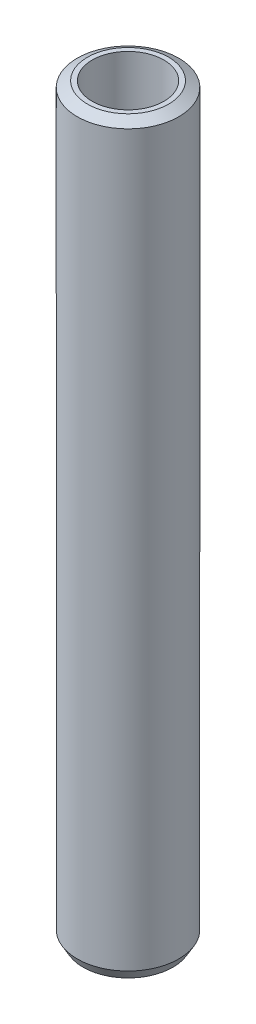
ISO-10303-21;
HEADER;
FILE_DESCRIPTION(('STEP AP214'),'2;1');
FILE_NAME('part.step','',(''),(''),'','','');
FILE_SCHEMA(('AUTOMOTIVE_DESIGN { 1 0 10303 214 1 1 1 1 }'));
ENDSEC;
DATA;
#1=APPLICATION_CONTEXT('core data for automotive mechanical design processes');
#2=APPLICATION_PROTOCOL_DEFINITION('international standard','automotive_design',2000,#1);
#3=PRODUCT_CONTEXT('',#1,'mechanical');
#4=PRODUCT('Part','Part','',(#3));
#5=PRODUCT_RELATED_PRODUCT_CATEGORY('part','',(#4));
#6=PRODUCT_DEFINITION_FORMATION('','',#4);
#7=PRODUCT_DEFINITION_CONTEXT('part definition',#1,'design');
#8=PRODUCT_DEFINITION('design','',#6,#7);
#9=PRODUCT_DEFINITION_SHAPE('','',#8);
#10=(LENGTH_UNIT() NAMED_UNIT(*) SI_UNIT(.MILLI.,.METRE.));
#11=(NAMED_UNIT(*) PLANE_ANGLE_UNIT() SI_UNIT($,.RADIAN.));
#12=(NAMED_UNIT(*) SI_UNIT($,.STERADIAN.) SOLID_ANGLE_UNIT());
#13=UNCERTAINTY_MEASURE_WITH_UNIT(LENGTH_MEASURE(1.E-05),#10,'distance_accuracy_value','');
#14=(GEOMETRIC_REPRESENTATION_CONTEXT(3) GLOBAL_UNCERTAINTY_ASSIGNED_CONTEXT((#13)) GLOBAL_UNIT_ASSIGNED_CONTEXT((#10,
#11,#12)) REPRESENTATION_CONTEXT('',''));
#15=CARTESIAN_POINT('',(0.,0.,0.));
#16=DIRECTION('',(0.,0.,1.));
#17=DIRECTION('',(1.,0.,0.));
#18=AXIS2_PLACEMENT_3D('',#15,#16,#17);
#19=CARTESIAN_POINT('',(0.,293.541253860282,0.));
#20=DIRECTION('',(0.,-1.,0.));
#21=DIRECTION('',(0.,0.,-1.));
#22=AXIS2_PLACEMENT_3D('',#19,#20,#21);
#23=CYLINDRICAL_SURFACE('',#22,20.);
#24=CARTESIAN_POINT('',(0.,291.232750182404,0.));
#25=DIRECTION('',(0.,1.,0.));
#26=DIRECTION('',(0.,0.,1.));
#27=AXIS2_PLACEMENT_3D('',#24,#25,#26);
#28=CIRCLE('',#27,20.);
#29=CARTESIAN_POINT('',(0.,291.232750182404,-20.));
#30=VERTEX_POINT('',#29);
#31=EDGE_CURVE('E50',#30,#30,#28,.F.);
#32=ORIENTED_EDGE('',*,*,#31,.T.);
#33=EDGE_LOOP('',(#32));
#34=FACE_BOUND('',#33,.T.);
#35=CARTESIAN_POINT('',(0.,3.9984456595441,0.));
#36=DIRECTION('',(0.,1.,0.));
#37=DIRECTION('',(0.,0.,1.));
#38=AXIS2_PLACEMENT_3D('',#35,#36,#37);
#39=CIRCLE('',#38,20.);
#40=CARTESIAN_POINT('',(0.,3.9984456595441,20.));
#41=VERTEX_POINT('',#40);
#42=EDGE_CURVE('E51',#41,#41,#39,.T.);
#43=ORIENTED_EDGE('',*,*,#42,.T.);
#44=EDGE_LOOP('',(#43));
#45=FACE_BOUND('',#44,.T.);
#46=ADVANCED_FACE('F39',(#34,#45),#23,.T.);
#47=CARTESIAN_POINT('',(0.,293.541253860282,0.));
#48=DIRECTION('',(0.,1.,0.));
#49=DIRECTION('',(0.,0.,1.));
#50=AXIS2_PLACEMENT_3D('',#47,#48,#49);
#51=PLANE('',#50);
#52=CARTESIAN_POINT('',(0.,293.541253860282,0.));
#53=DIRECTION('',(0.,1.,0.));
#54=DIRECTION('',(0.,0.,1.));
#55=AXIS2_PLACEMENT_3D('',#52,#53,#54);
#56=CIRCLE('',#55,16.0015543404559);
#57=CARTESIAN_POINT('',(0.,293.541253860282,-16.001554340456));
#58=VERTEX_POINT('',#57);
#59=EDGE_CURVE('E54',#58,#58,#56,.T.);
#60=ORIENTED_EDGE('',*,*,#59,.T.);
#61=EDGE_LOOP('',(#60));
#62=FACE_BOUND('',#61,.T.);
#63=CARTESIAN_POINT('',(0.,293.541253860282,0.));
#64=DIRECTION('',(0.,1.,0.));
#65=DIRECTION('',(0.,0.,1.));
#66=AXIS2_PLACEMENT_3D('',#63,#64,#65);
#67=CIRCLE('',#66,14.1167200227199);
#68=CARTESIAN_POINT('',(0.,293.541253860282,14.1167200227199));
#69=VERTEX_POINT('',#68);
#70=EDGE_CURVE('E58',#69,#69,#67,.T.);
#71=ORIENTED_EDGE('',*,*,#70,.F.);
#72=EDGE_LOOP('',(#71));
#73=FACE_BOUND('',#72,.T.);
#74=ADVANCED_FACE('F69',(#62,#73),#51,.T.);
#75=CARTESIAN_POINT('',(0.,0.,0.));
#76=DIRECTION('',(0.,1.,0.));
#77=DIRECTION('',(0.,0.,1.));
#78=AXIS2_PLACEMENT_3D('',#75,#76,#77);
#79=PLANE('',#78);
#80=CARTESIAN_POINT('',(0.,0.,0.));
#81=DIRECTION('',(0.,1.,0.));
#82=DIRECTION('',(0.,0.,1.));
#83=AXIS2_PLACEMENT_3D('',#80,#81,#82);
#84=CIRCLE('',#83,17.6914963221221);
#85=CARTESIAN_POINT('',(0.,0.,17.6914963221221));
#86=VERTEX_POINT('',#85);
#87=EDGE_CURVE('E10',#86,#86,#84,.F.);
#88=ORIENTED_EDGE('',*,*,#87,.T.);
#89=EDGE_LOOP('',(#88));
#90=FACE_BOUND('',#89,.T.);
#91=CARTESIAN_POINT('',(0.,0.,0.));
#92=DIRECTION('',(0.,1.,0.));
#93=DIRECTION('',(0.,0.,1.));
#94=AXIS2_PLACEMENT_3D('',#91,#92,#93);
#95=CIRCLE('',#94,14.1167200227199);
#96=CARTESIAN_POINT('',(0.,0.,14.1167200227199));
#97=VERTEX_POINT('',#96);
#98=EDGE_CURVE('E63',#97,#97,#95,.T.);
#99=ORIENTED_EDGE('',*,*,#98,.T.);
#100=EDGE_LOOP('',(#99));
#101=FACE_BOUND('',#100,.T.);
#102=ADVANCED_FACE('F75',(#90,#101),#79,.F.);
#103=CARTESIAN_POINT('',(0.,293.541253860282,0.));
#104=DIRECTION('',(0.,-1.,0.));
#105=DIRECTION('',(0.,0.,-1.));
#106=AXIS2_PLACEMENT_3D('',#103,#104,#105);
#107=CYLINDRICAL_SURFACE('',#106,14.1167200227199);
#108=ORIENTED_EDGE('',*,*,#70,.T.);
#109=EDGE_LOOP('',(#108));
#110=FACE_BOUND('',#109,.T.);
#111=ORIENTED_EDGE('',*,*,#98,.F.);
#112=EDGE_LOOP('',(#111));
#113=FACE_BOUND('',#112,.T.);
#114=ADVANCED_FACE('F70',(#110,#113),#107,.F.);
#115=CARTESIAN_POINT('',(0.,293.541253860282,0.));
#116=DIRECTION('',(0.,-1.,0.));
#117=DIRECTION('',(0.,0.,-1.));
#118=AXIS2_PLACEMENT_3D('',#115,#116,#117);
#119=CONICAL_SURFACE('',#118,16.0015543404559,1.0471975511966);
#120=CARTESIAN_POINT('',(0.,291.232750182404,-20.));
#121=CARTESIAN_POINT('',(0.,291.256797095715,-19.9583495243798));
#122=CARTESIAN_POINT('',(0.,291.280844009027,-19.9166990487596));
#123=CARTESIAN_POINT('',(0.,291.328937835649,-19.8333980975191));
#124=CARTESIAN_POINT('',(0.,291.35298474896,-19.7917476218988));
#125=CARTESIAN_POINT('',(0.,291.401078575583,-19.7084466706583));
#126=CARTESIAN_POINT('',(0.,291.425125488894,-19.666796195038));
#127=CARTESIAN_POINT('',(0.,291.473219315516,-19.5834952437975));
#128=CARTESIAN_POINT('',(0.,291.497266228828,-19.5418447681773));
#129=CARTESIAN_POINT('',(0.,291.54536005545,-19.4585438169368));
#130=CARTESIAN_POINT('',(0.,291.569406968761,-19.4168933413165));
#131=CARTESIAN_POINT('',(0.,291.617500795384,-19.333592390076));
#132=CARTESIAN_POINT('',(0.,291.641547708695,-19.2919419144558));
#133=CARTESIAN_POINT('',(0.,291.689641535317,-19.2086409632153));
#134=CARTESIAN_POINT('',(0.,291.713688448629,-19.166990487595));
#135=CARTESIAN_POINT('',(0.,291.761782275251,-19.0836895363545));
#136=CARTESIAN_POINT('',(0.,291.785829188562,-19.0420390607343));
#137=CARTESIAN_POINT('',(0.,291.833923015185,-18.9587381094938));
#138=CARTESIAN_POINT('',(0.,291.857969928496,-18.9170876338735));
#139=CARTESIAN_POINT('',(0.,291.906063755118,-18.833786682633));
#140=CARTESIAN_POINT('',(0.,291.93011066843,-18.7921362070128));
#141=CARTESIAN_POINT('',(0.,291.978204495052,-18.7088352557723));
#142=CARTESIAN_POINT('',(0.,292.002251408363,-18.667184780152));
#143=CARTESIAN_POINT('',(0.,292.050345234986,-18.5838838289115));
#144=CARTESIAN_POINT('',(0.,292.074392148297,-18.5422333532913));
#145=CARTESIAN_POINT('',(0.,292.12248597492,-18.4589324020508));
#146=CARTESIAN_POINT('',(0.,292.146532888231,-18.4172819264305));
#147=CARTESIAN_POINT('',(0.,292.194626714853,-18.33398097519));
#148=CARTESIAN_POINT('',(0.,292.218673628164,-18.2923304995698));
#149=CARTESIAN_POINT('',(0.,292.266767454787,-18.2090295483293));
#150=CARTESIAN_POINT('',(0.,292.290814368098,-18.167379072709));
#151=CARTESIAN_POINT('',(0.,292.338908194721,-18.0840781214685));
#152=CARTESIAN_POINT('',(0.,292.362955108032,-18.0424276458483));
#153=CARTESIAN_POINT('',(0.,292.411048934654,-17.9591266946078));
#154=CARTESIAN_POINT('',(0.,292.435095847965,-17.9174762189875));
#155=CARTESIAN_POINT('',(0.,292.483189674588,-17.834175267747));
#156=CARTESIAN_POINT('',(0.,292.507236587899,-17.7925247921268));
#157=CARTESIAN_POINT('',(0.,292.555330414522,-17.7092238408863));
#158=CARTESIAN_POINT('',(0.,292.579377327833,-17.667573365266));
#159=CARTESIAN_POINT('',(0.,292.627471154455,-17.5842724140255));
#160=CARTESIAN_POINT('',(0.,292.651518067767,-17.5426219384052));
#161=CARTESIAN_POINT('',(0.,292.699611894389,-17.4593209871647));
#162=CARTESIAN_POINT('',(0.,292.7236588077,-17.4176705115445));
#163=CARTESIAN_POINT('',(0.,292.771752634323,-17.334369560304));
#164=CARTESIAN_POINT('',(0.,292.795799547634,-17.2927190846837));
#165=CARTESIAN_POINT('',(0.,292.843893374256,-17.2094181334432));
#166=CARTESIAN_POINT('',(0.,292.867940287568,-17.167767657823));
#167=CARTESIAN_POINT('',(0.,292.91603411419,-17.0844667065825));
#168=CARTESIAN_POINT('',(0.,292.940081027501,-17.0428162309622));
#169=CARTESIAN_POINT('',(0.,292.988174854124,-16.9595152797217));
#170=CARTESIAN_POINT('',(0.,293.012221767435,-16.9178648041015));
#171=CARTESIAN_POINT('',(0.,293.060315594057,-16.834563852861));
#172=CARTESIAN_POINT('',(0.,293.084362507369,-16.7929133772407));
#173=CARTESIAN_POINT('',(0.,293.132456333991,-16.7096124260002));
#174=CARTESIAN_POINT('',(0.,293.156503247302,-16.66796195038));
#175=CARTESIAN_POINT('',(0.,293.204597073925,-16.5846609991395));
#176=CARTESIAN_POINT('',(0.,293.228643987236,-16.5430105235192));
#177=CARTESIAN_POINT('',(0.,293.276737813859,-16.4597095722787));
#178=CARTESIAN_POINT('',(0.,293.30078472717,-16.4180590966585));
#179=CARTESIAN_POINT('',(0.,293.348878553792,-16.334758145418));
#180=CARTESIAN_POINT('',(0.,293.372925467103,-16.2931076697977));
#181=CARTESIAN_POINT('',(0.,293.421019293726,-16.2098067185572));
#182=CARTESIAN_POINT('',(0.,293.445066207037,-16.168156242937));
#183=CARTESIAN_POINT('',(0.,293.49316003366,-16.0848552916965));
#184=CARTESIAN_POINT('',(0.,293.517206946971,-16.0432048160762));
#185=CARTESIAN_POINT('',(0.,293.541253860282,-16.001554340456));
#186=B_SPLINE_CURVE_WITH_KNOTS('',3,(#120,#121,#122,#123,#124,#125,#126,#127,#128,#129,#130,
#131,#132,#133,#134,#135,#136,#137,#138,#139,#140,#141,#142,#143,#144,#145,#146,#147,#148,#149,
#150,#151,#152,#153,#154,#155,#156,#157,#158,#159,#160,#161,#162,#163,#164,#165,#166,#167,#168,
#169,#170,#171,#172,#173,#174,#175,#176,#177,#178,#179,#180,#181,#182,#183,#184,#185),
.UNSPECIFIED.,.F.,.F.,(4,2,2,2,2,2,2,2,2,2,2,2,2,2,2,2,2,2,2,2,2,2,2,2,2,2,2,2,2,2,2,2,4),(0.,
0.144281479867384,0.288562959734744,0.432844439602104,0.577125919469491,0.721407399336851,
0.86568887920421,1.00997035907157,1.15425183893896,1.29853331880631,1.44281479867367,
1.58709627854106,1.73137775840842,1.87565923827578,2.01994071814314,2.16422219801052,
2.30850367787788,2.45278515774524,2.59706663761263,2.74134811747999,2.88562959734735,
3.02991107721471,3.1741925570821,3.31847403694946,3.46275551681682,3.6070369966842,
3.75131847655156,3.89559995641892,4.03988143628628,4.18416291615367,4.32844439602103,
4.47272587588839,4.61700735575577),.UNSPECIFIED.);
#187=EDGE_CURVE('BSEAM81',#30,#58,#186,.T.);
#188=ORIENTED_EDGE('',*,*,#31,.F.);
#189=ORIENTED_EDGE('',*,*,#59,.F.);
#190=ORIENTED_EDGE('',*,*,#187,.T.);
#191=ORIENTED_EDGE('',*,*,#187,.F.);
#192=EDGE_LOOP('',(#188,#190,#189,#191));
#193=FACE_BOUND('',#192,.T.);
#194=ADVANCED_FACE('F81',(#193),#119,.T.);
#195=CARTESIAN_POINT('',(0.,3.9984456595441,0.));
#196=DIRECTION('',(0.,1.,0.));
#197=DIRECTION('',(0.,0.,1.));
#198=AXIS2_PLACEMENT_3D('',#195,#196,#197);
#199=CONICAL_SURFACE('',#198,20.,0.523598775598307);
#200=ORIENTED_EDGE('',*,*,#87,.F.);
#201=EDGE_LOOP('',(#200));
#202=FACE_BOUND('',#201,.T.);
#203=ORIENTED_EDGE('',*,*,#42,.F.);
#204=EDGE_LOOP('',(#203));
#205=FACE_BOUND('',#204,.T.);
#206=ADVANCED_FACE('F45',(#202,#205),#199,.T.);
#207=CLOSED_SHELL('',(#46,#74,#102,#114,#194,#206));
#208=MANIFOLD_SOLID_BREP('B2',#207);
#209=ADVANCED_BREP_SHAPE_REPRESENTATION('',(#18,#208),#14);
#210=SHAPE_DEFINITION_REPRESENTATION(#9,#209);
ENDSEC;
END-ISO-10303-21;
